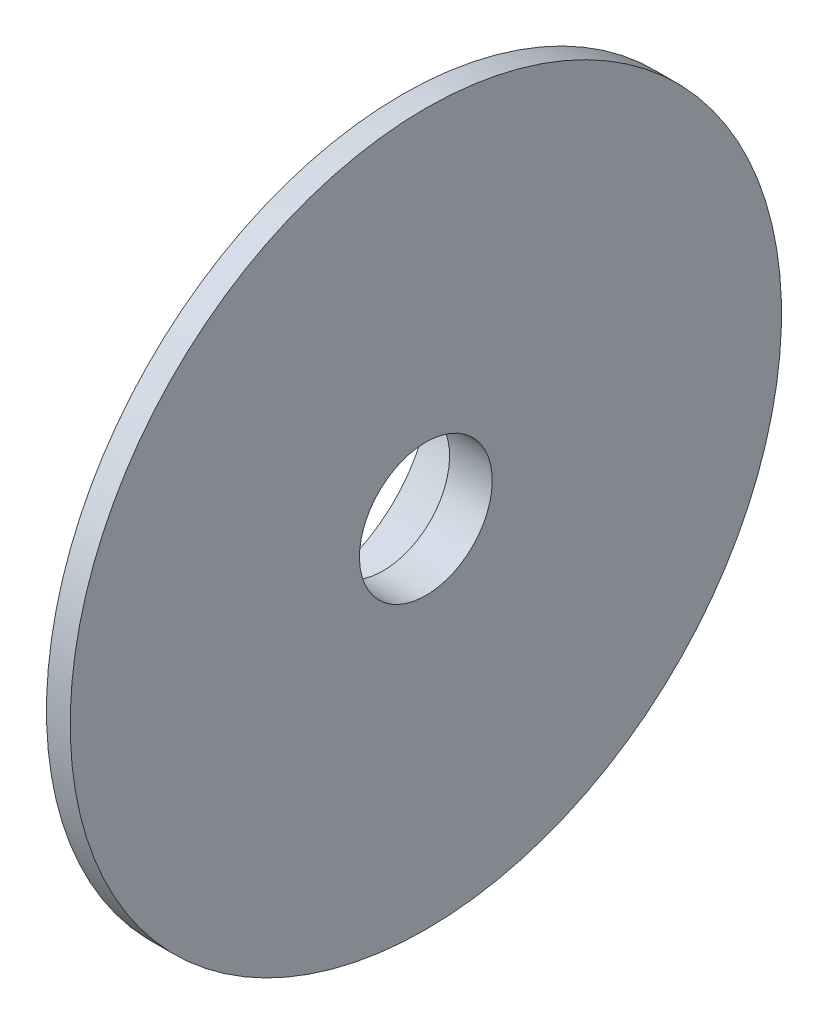
ISO-10303-21;
HEADER;
FILE_DESCRIPTION(('STEP AP214'),'2;1');
FILE_NAME('part.step','',(''),(''),'','','');
FILE_SCHEMA(('AUTOMOTIVE_DESIGN { 1 0 10303 214 1 1 1 1 }'));
ENDSEC;
DATA;
#1=APPLICATION_CONTEXT('core data for automotive mechanical design processes');
#2=APPLICATION_PROTOCOL_DEFINITION('international standard','automotive_design',2000,#1);
#3=PRODUCT_CONTEXT('',#1,'mechanical');
#4=PRODUCT('Part','Part','',(#3));
#5=PRODUCT_RELATED_PRODUCT_CATEGORY('part','',(#4));
#6=PRODUCT_DEFINITION_FORMATION('','',#4);
#7=PRODUCT_DEFINITION_CONTEXT('part definition',#1,'design');
#8=PRODUCT_DEFINITION('design','',#6,#7);
#9=PRODUCT_DEFINITION_SHAPE('','',#8);
#10=(LENGTH_UNIT() NAMED_UNIT(*) SI_UNIT(.MILLI.,.METRE.));
#11=(NAMED_UNIT(*) PLANE_ANGLE_UNIT() SI_UNIT($,.RADIAN.));
#12=(NAMED_UNIT(*) SI_UNIT($,.STERADIAN.) SOLID_ANGLE_UNIT());
#13=UNCERTAINTY_MEASURE_WITH_UNIT(LENGTH_MEASURE(1.E-05),#10,'distance_accuracy_value','');
#14=(GEOMETRIC_REPRESENTATION_CONTEXT(3) GLOBAL_UNCERTAINTY_ASSIGNED_CONTEXT((#13)) GLOBAL_UNIT_ASSIGNED_CONTEXT((#10,
#11,#12)) REPRESENTATION_CONTEXT('',''));
#15=CARTESIAN_POINT('',(0.,0.,0.));
#16=DIRECTION('',(0.,0.,1.));
#17=DIRECTION('',(1.,0.,0.));
#18=AXIS2_PLACEMENT_3D('',#15,#16,#17);
#19=CARTESIAN_POINT('',(0.,0.,0.));
#20=DIRECTION('',(1.,0.,0.));
#21=DIRECTION('',(0.,1.,0.));
#22=AXIS2_PLACEMENT_3D('',#19,#20,#21);
#23=CYLINDRICAL_SURFACE('',#22,26.9999999999999);
#24=CARTESIAN_POINT('',(-5.99999999999999,0.,0.));
#25=DIRECTION('',(1.,0.,0.));
#26=DIRECTION('',(0.,1.,0.));
#27=AXIS2_PLACEMENT_3D('',#24,#25,#26);
#28=CIRCLE('',#27,26.9999999999999);
#29=CARTESIAN_POINT('',(-6.,26.9999999999999,0.));
#30=VERTEX_POINT('',#29);
#31=EDGE_CURVE('E10',#30,#30,#28,.T.);
#32=ORIENTED_EDGE('',*,*,#31,.T.);
#33=EDGE_LOOP('',(#32));
#34=FACE_BOUND('',#33,.T.);
#35=CARTESIAN_POINT('',(-2.5,0.,0.));
#36=DIRECTION('',(1.,0.,0.));
#37=DIRECTION('',(0.,1.,0.));
#38=AXIS2_PLACEMENT_3D('',#35,#36,#37);
#39=CIRCLE('',#38,26.9999999999999);
#40=CARTESIAN_POINT('',(-2.5,26.9999999999999,0.));
#41=VERTEX_POINT('',#40);
#42=EDGE_CURVE('E88',#41,#41,#39,.T.);
#43=ORIENTED_EDGE('',*,*,#42,.F.);
#44=EDGE_LOOP('',(#43));
#45=FACE_BOUND('',#44,.T.);
#46=ADVANCED_FACE('F24',(#34,#45),#23,.T.);
#47=CARTESIAN_POINT('',(-6.,26.9999999999999,0.));
#48=DIRECTION('',(-1.,0.,0.));
#49=DIRECTION('',(0.,-1.,0.));
#50=AXIS2_PLACEMENT_3D('',#47,#48,#49);
#51=PLANE('',#50);
#52=CARTESIAN_POINT('',(-5.99999999999999,0.,0.));
#53=DIRECTION('',(1.,0.,0.));
#54=DIRECTION('',(0.,1.,0.));
#55=AXIS2_PLACEMENT_3D('',#52,#53,#54);
#56=CIRCLE('',#55,24.9999999999999);
#57=CARTESIAN_POINT('',(-6.,24.9999999999999,0.));
#58=VERTEX_POINT('',#57);
#59=EDGE_CURVE('E30',#58,#58,#56,.T.);
#60=ORIENTED_EDGE('',*,*,#59,.T.);
#61=EDGE_LOOP('',(#60));
#62=FACE_BOUND('',#61,.T.);
#63=ORIENTED_EDGE('',*,*,#31,.F.);
#64=EDGE_LOOP('',(#63));
#65=FACE_BOUND('',#64,.T.);
#66=ADVANCED_FACE('F96',(#62,#65),#51,.T.);
#67=CARTESIAN_POINT('',(0.,0.,0.));
#68=DIRECTION('',(1.,0.,0.));
#69=DIRECTION('',(0.,1.,0.));
#70=AXIS2_PLACEMENT_3D('',#67,#68,#69);
#71=CYLINDRICAL_SURFACE('',#70,24.9999999999999);
#72=CARTESIAN_POINT('',(-2.5,0.,0.));
#73=DIRECTION('',(1.,0.,0.));
#74=DIRECTION('',(0.,1.,0.));
#75=AXIS2_PLACEMENT_3D('',#72,#73,#74);
#76=CIRCLE('',#75,24.9999999999999);
#77=CARTESIAN_POINT('',(-2.5,24.9999999999999,0.));
#78=VERTEX_POINT('',#77);
#79=EDGE_CURVE('E34',#78,#78,#76,.T.);
#80=ORIENTED_EDGE('',*,*,#79,.T.);
#81=EDGE_LOOP('',(#80));
#82=FACE_BOUND('',#81,.T.);
#83=ORIENTED_EDGE('',*,*,#59,.F.);
#84=EDGE_LOOP('',(#83));
#85=FACE_BOUND('',#84,.T.);
#86=ADVANCED_FACE('F100',(#82,#85),#71,.F.);
#87=CARTESIAN_POINT('',(-2.5,24.9999999999999,0.));
#88=DIRECTION('',(-1.,0.,0.));
#89=DIRECTION('',(0.,-1.,0.));
#90=AXIS2_PLACEMENT_3D('',#87,#88,#89);
#91=PLANE('',#90);
#92=CARTESIAN_POINT('',(-2.5,0.,0.));
#93=DIRECTION('',(1.,0.,0.));
#94=DIRECTION('',(0.,1.,0.));
#95=AXIS2_PLACEMENT_3D('',#92,#93,#94);
#96=CIRCLE('',#95,14.9999999999999);
#97=CARTESIAN_POINT('',(-2.5,14.9999999999999,0.));
#98=VERTEX_POINT('',#97);
#99=EDGE_CURVE('E38',#98,#98,#96,.T.);
#100=ORIENTED_EDGE('',*,*,#99,.T.);
#101=EDGE_LOOP('',(#100));
#102=FACE_BOUND('',#101,.T.);
#103=ORIENTED_EDGE('',*,*,#79,.F.);
#104=EDGE_LOOP('',(#103));
#105=FACE_BOUND('',#104,.T.);
#106=ADVANCED_FACE('F104',(#102,#105),#91,.T.);
#107=CARTESIAN_POINT('',(0.,0.,0.));
#108=DIRECTION('',(1.,0.,0.));
#109=DIRECTION('',(0.,1.,0.));
#110=AXIS2_PLACEMENT_3D('',#107,#108,#109);
#111=CYLINDRICAL_SURFACE('',#110,14.9999999999999);
#112=CARTESIAN_POINT('',(-7.5,0.,0.));
#113=DIRECTION('',(1.,0.,0.));
#114=DIRECTION('',(0.,1.,0.));
#115=AXIS2_PLACEMENT_3D('',#112,#113,#114);
#116=CIRCLE('',#115,14.9999999999999);
#117=CARTESIAN_POINT('',(-7.5,14.9999999999999,0.));
#118=VERTEX_POINT('',#117);
#119=EDGE_CURVE('E43',#118,#118,#116,.T.);
#120=ORIENTED_EDGE('',*,*,#119,.T.);
#121=EDGE_LOOP('',(#120));
#122=FACE_BOUND('',#121,.T.);
#123=ORIENTED_EDGE('',*,*,#99,.F.);
#124=EDGE_LOOP('',(#123));
#125=FACE_BOUND('',#124,.T.);
#126=ADVANCED_FACE('F111',(#122,#125),#111,.T.);
#127=CARTESIAN_POINT('',(-7.5,14.9999999999999,0.));
#128=DIRECTION('',(-1.,0.,0.));
#129=DIRECTION('',(0.,-1.,0.));
#130=AXIS2_PLACEMENT_3D('',#127,#128,#129);
#131=PLANE('',#130);
#132=CARTESIAN_POINT('',(-7.5,0.,0.));
#133=DIRECTION('',(1.,0.,0.));
#134=DIRECTION('',(0.,1.,0.));
#135=AXIS2_PLACEMENT_3D('',#132,#133,#134);
#136=CIRCLE('',#135,14.3499999999999);
#137=CARTESIAN_POINT('',(-7.5,14.3499999999999,0.));
#138=VERTEX_POINT('',#137);
#139=EDGE_CURVE('E46',#138,#138,#136,.T.);
#140=ORIENTED_EDGE('',*,*,#139,.T.);
#141=EDGE_LOOP('',(#140));
#142=FACE_BOUND('',#141,.T.);
#143=ORIENTED_EDGE('',*,*,#119,.F.);
#144=EDGE_LOOP('',(#143));
#145=FACE_BOUND('',#144,.T.);
#146=ADVANCED_FACE('F115',(#142,#145),#131,.T.);
#147=CARTESIAN_POINT('',(0.,0.,0.));
#148=DIRECTION('',(1.,0.,0.));
#149=DIRECTION('',(0.,1.,0.));
#150=AXIS2_PLACEMENT_3D('',#147,#148,#149);
#151=CYLINDRICAL_SURFACE('',#150,14.3499999999999);
#152=CARTESIAN_POINT('',(-8.49999999999999,0.,0.));
#153=DIRECTION('',(1.,0.,0.));
#154=DIRECTION('',(0.,1.,0.));
#155=AXIS2_PLACEMENT_3D('',#152,#153,#154);
#156=CIRCLE('',#155,14.3499999999999);
#157=CARTESIAN_POINT('',(-8.5,14.3499999999999,0.));
#158=VERTEX_POINT('',#157);
#159=EDGE_CURVE('E49',#158,#158,#156,.T.);
#160=ORIENTED_EDGE('',*,*,#159,.T.);
#161=EDGE_LOOP('',(#160));
#162=FACE_BOUND('',#161,.T.);
#163=ORIENTED_EDGE('',*,*,#139,.F.);
#164=EDGE_LOOP('',(#163));
#165=FACE_BOUND('',#164,.T.);
#166=ADVANCED_FACE('F119',(#162,#165),#151,.T.);
#167=CARTESIAN_POINT('',(-8.5,14.3499999999999,0.));
#168=DIRECTION('',(1.,0.,0.));
#169=DIRECTION('',(0.,1.,0.));
#170=AXIS2_PLACEMENT_3D('',#167,#168,#169);
#171=PLANE('',#170);
#172=CARTESIAN_POINT('',(-8.49999999999999,0.,0.));
#173=DIRECTION('',(1.,0.,0.));
#174=DIRECTION('',(0.,1.,0.));
#175=AXIS2_PLACEMENT_3D('',#172,#173,#174);
#176=CIRCLE('',#175,14.9999999999999);
#177=CARTESIAN_POINT('',(-8.5,14.9999999999999,0.));
#178=VERTEX_POINT('',#177);
#179=EDGE_CURVE('E52',#178,#178,#176,.T.);
#180=ORIENTED_EDGE('',*,*,#179,.T.);
#181=EDGE_LOOP('',(#180));
#182=FACE_BOUND('',#181,.T.);
#183=ORIENTED_EDGE('',*,*,#159,.F.);
#184=EDGE_LOOP('',(#183));
#185=FACE_BOUND('',#184,.T.);
#186=ADVANCED_FACE('F123',(#182,#185),#171,.T.);
#187=CARTESIAN_POINT('',(0.,0.,0.));
#188=DIRECTION('',(1.,0.,0.));
#189=DIRECTION('',(0.,1.,0.));
#190=AXIS2_PLACEMENT_3D('',#187,#188,#189);
#191=CYLINDRICAL_SURFACE('',#190,14.9999999999999);
#192=CARTESIAN_POINT('',(-12.5,0.,0.));
#193=DIRECTION('',(1.,0.,0.));
#194=DIRECTION('',(0.,1.,0.));
#195=AXIS2_PLACEMENT_3D('',#192,#193,#194);
#196=CIRCLE('',#195,14.9999999999999);
#197=CARTESIAN_POINT('',(-12.5,14.9999999999999,0.));
#198=VERTEX_POINT('',#197);
#199=EDGE_CURVE('E55',#198,#198,#196,.T.);
#200=ORIENTED_EDGE('',*,*,#199,.T.);
#201=EDGE_LOOP('',(#200));
#202=FACE_BOUND('',#201,.T.);
#203=ORIENTED_EDGE('',*,*,#179,.F.);
#204=EDGE_LOOP('',(#203));
#205=FACE_BOUND('',#204,.T.);
#206=ADVANCED_FACE('F127',(#202,#205),#191,.T.);
#207=CARTESIAN_POINT('',(-12.5,14.9999999999999,0.));
#208=DIRECTION('',(-1.,0.,0.));
#209=DIRECTION('',(0.,-1.,0.));
#210=AXIS2_PLACEMENT_3D('',#207,#208,#209);
#211=PLANE('',#210);
#212=CARTESIAN_POINT('',(-12.5,0.,0.));
#213=DIRECTION('',(1.,0.,0.));
#214=DIRECTION('',(0.,1.,0.));
#215=AXIS2_PLACEMENT_3D('',#212,#213,#214);
#216=CIRCLE('',#215,12.9999999999999);
#217=CARTESIAN_POINT('',(-12.5,12.9999999999999,0.));
#218=VERTEX_POINT('',#217);
#219=EDGE_CURVE('E58',#218,#218,#216,.T.);
#220=ORIENTED_EDGE('',*,*,#219,.T.);
#221=EDGE_LOOP('',(#220));
#222=FACE_BOUND('',#221,.T.);
#223=ORIENTED_EDGE('',*,*,#199,.F.);
#224=EDGE_LOOP('',(#223));
#225=FACE_BOUND('',#224,.T.);
#226=ADVANCED_FACE('F131',(#222,#225),#211,.T.);
#227=CARTESIAN_POINT('',(0.,0.,0.));
#228=DIRECTION('',(1.,0.,0.));
#229=DIRECTION('',(0.,1.,0.));
#230=AXIS2_PLACEMENT_3D('',#227,#228,#229);
#231=CYLINDRICAL_SURFACE('',#230,12.9999999999999);
#232=CARTESIAN_POINT('',(-5.,0.,0.));
#233=DIRECTION('',(1.,0.,0.));
#234=DIRECTION('',(0.,1.,0.));
#235=AXIS2_PLACEMENT_3D('',#232,#233,#234);
#236=CIRCLE('',#235,12.9999999999999);
#237=CARTESIAN_POINT('',(-5.,12.9999999999999,0.));
#238=VERTEX_POINT('',#237);
#239=EDGE_CURVE('E61',#238,#238,#236,.T.);
#240=ORIENTED_EDGE('',*,*,#239,.T.);
#241=EDGE_LOOP('',(#240));
#242=FACE_BOUND('',#241,.T.);
#243=ORIENTED_EDGE('',*,*,#219,.F.);
#244=EDGE_LOOP('',(#243));
#245=FACE_BOUND('',#244,.T.);
#246=ADVANCED_FACE('F135',(#242,#245),#231,.F.);
#247=CARTESIAN_POINT('',(-5.,12.9999999999999,0.));
#248=DIRECTION('',(-1.,0.,0.));
#249=DIRECTION('',(0.,-1.,0.));
#250=AXIS2_PLACEMENT_3D('',#247,#248,#249);
#251=PLANE('',#250);
#252=CARTESIAN_POINT('',(-5.,0.,0.));
#253=DIRECTION('',(1.,0.,0.));
#254=DIRECTION('',(0.,1.,0.));
#255=AXIS2_PLACEMENT_3D('',#252,#253,#254);
#256=CIRCLE('',#255,11.4999999999999);
#257=CARTESIAN_POINT('',(-5.,11.4999999999999,0.));
#258=VERTEX_POINT('',#257);
#259=EDGE_CURVE('E64',#258,#258,#256,.T.);
#260=ORIENTED_EDGE('',*,*,#259,.T.);
#261=EDGE_LOOP('',(#260));
#262=FACE_BOUND('',#261,.T.);
#263=ORIENTED_EDGE('',*,*,#239,.F.);
#264=EDGE_LOOP('',(#263));
#265=FACE_BOUND('',#264,.T.);
#266=ADVANCED_FACE('F139',(#262,#265),#251,.T.);
#267=CARTESIAN_POINT('',(0.,0.,0.));
#268=DIRECTION('',(1.,0.,0.));
#269=DIRECTION('',(0.,1.,0.));
#270=AXIS2_PLACEMENT_3D('',#267,#268,#269);
#271=CYLINDRICAL_SURFACE('',#270,11.4999999999999);
#272=CARTESIAN_POINT('',(-2.,0.,0.));
#273=DIRECTION('',(1.,0.,0.));
#274=DIRECTION('',(0.,1.,0.));
#275=AXIS2_PLACEMENT_3D('',#272,#273,#274);
#276=CIRCLE('',#275,11.4999999999999);
#277=CARTESIAN_POINT('',(-2.,11.4999999999999,0.));
#278=VERTEX_POINT('',#277);
#279=EDGE_CURVE('E67',#278,#278,#276,.T.);
#280=ORIENTED_EDGE('',*,*,#279,.T.);
#281=EDGE_LOOP('',(#280));
#282=FACE_BOUND('',#281,.T.);
#283=ORIENTED_EDGE('',*,*,#259,.F.);
#284=EDGE_LOOP('',(#283));
#285=FACE_BOUND('',#284,.T.);
#286=ADVANCED_FACE('F143',(#282,#285),#271,.F.);
#287=CARTESIAN_POINT('',(-2.,11.4999999999999,0.));
#288=DIRECTION('',(-1.,0.,0.));
#289=DIRECTION('',(0.,-1.,0.));
#290=AXIS2_PLACEMENT_3D('',#287,#288,#289);
#291=PLANE('',#290);
#292=CARTESIAN_POINT('',(-2.,0.,0.));
#293=DIRECTION('',(1.,0.,0.));
#294=DIRECTION('',(0.,1.,0.));
#295=AXIS2_PLACEMENT_3D('',#292,#293,#294);
#296=CIRCLE('',#295,8.99999999999994);
#297=CARTESIAN_POINT('',(-2.,8.99999999999994,0.));
#298=VERTEX_POINT('',#297);
#299=EDGE_CURVE('E70',#298,#298,#296,.T.);
#300=ORIENTED_EDGE('',*,*,#299,.T.);
#301=EDGE_LOOP('',(#300));
#302=FACE_BOUND('',#301,.T.);
#303=ORIENTED_EDGE('',*,*,#279,.F.);
#304=EDGE_LOOP('',(#303));
#305=FACE_BOUND('',#304,.T.);
#306=ADVANCED_FACE('F147',(#302,#305),#291,.T.);
#307=CARTESIAN_POINT('',(0.,0.,0.));
#308=DIRECTION('',(1.,0.,0.));
#309=DIRECTION('',(0.,1.,0.));
#310=AXIS2_PLACEMENT_3D('',#307,#308,#309);
#311=CYLINDRICAL_SURFACE('',#310,8.99999999999994);
#312=CARTESIAN_POINT('',(-4.5,0.,0.));
#313=DIRECTION('',(1.,0.,0.));
#314=DIRECTION('',(0.,1.,0.));
#315=AXIS2_PLACEMENT_3D('',#312,#313,#314);
#316=CIRCLE('',#315,8.99999999999994);
#317=CARTESIAN_POINT('',(-4.5,8.99999999999994,0.));
#318=VERTEX_POINT('',#317);
#319=EDGE_CURVE('E73',#318,#318,#316,.T.);
#320=ORIENTED_EDGE('',*,*,#319,.T.);
#321=EDGE_LOOP('',(#320));
#322=FACE_BOUND('',#321,.T.);
#323=ORIENTED_EDGE('',*,*,#299,.F.);
#324=EDGE_LOOP('',(#323));
#325=FACE_BOUND('',#324,.T.);
#326=ADVANCED_FACE('F151',(#322,#325),#311,.T.);
#327=CARTESIAN_POINT('',(-4.5,8.99999999999994,0.));
#328=DIRECTION('',(-1.,0.,0.));
#329=DIRECTION('',(0.,-1.,0.));
#330=AXIS2_PLACEMENT_3D('',#327,#328,#329);
#331=PLANE('',#330);
#332=CARTESIAN_POINT('',(-4.5,0.,0.));
#333=DIRECTION('',(1.,0.,0.));
#334=DIRECTION('',(0.,1.,0.));
#335=AXIS2_PLACEMENT_3D('',#332,#333,#334);
#336=CIRCLE('',#335,6.99999999999995);
#337=CARTESIAN_POINT('',(-4.5,6.99999999999995,0.));
#338=VERTEX_POINT('',#337);
#339=EDGE_CURVE('E76',#338,#338,#336,.T.);
#340=ORIENTED_EDGE('',*,*,#339,.T.);
#341=EDGE_LOOP('',(#340));
#342=FACE_BOUND('',#341,.T.);
#343=ORIENTED_EDGE('',*,*,#319,.F.);
#344=EDGE_LOOP('',(#343));
#345=FACE_BOUND('',#344,.T.);
#346=ADVANCED_FACE('F155',(#342,#345),#331,.T.);
#347=CARTESIAN_POINT('',(0.,0.,0.));
#348=DIRECTION('',(1.,0.,0.));
#349=DIRECTION('',(0.,1.,0.));
#350=AXIS2_PLACEMENT_3D('',#347,#348,#349);
#351=CYLINDRICAL_SURFACE('',#350,6.99999999999995);
#352=CARTESIAN_POINT('',(0.,0.,0.));
#353=DIRECTION('',(1.,0.,0.));
#354=DIRECTION('',(0.,1.,0.));
#355=AXIS2_PLACEMENT_3D('',#352,#353,#354);
#356=CIRCLE('',#355,6.99999999999995);
#357=CARTESIAN_POINT('',(0.,6.99999999999995,0.));
#358=VERTEX_POINT('',#357);
#359=EDGE_CURVE('E79',#358,#358,#356,.T.);
#360=ORIENTED_EDGE('',*,*,#359,.T.);
#361=EDGE_LOOP('',(#360));
#362=FACE_BOUND('',#361,.T.);
#363=ORIENTED_EDGE('',*,*,#339,.F.);
#364=EDGE_LOOP('',(#363));
#365=FACE_BOUND('',#364,.T.);
#366=ADVANCED_FACE('F159',(#362,#365),#351,.F.);
#367=CARTESIAN_POINT('',(0.,37.5,0.));
#368=DIRECTION('',(1.,0.,0.));
#369=DIRECTION('',(0.,1.,0.));
#370=AXIS2_PLACEMENT_3D('',#367,#368,#369);
#371=PLANE('',#370);
#372=CARTESIAN_POINT('',(0.,0.,0.));
#373=DIRECTION('',(1.,0.,0.));
#374=DIRECTION('',(0.,1.,0.));
#375=AXIS2_PLACEMENT_3D('',#372,#373,#374);
#376=CIRCLE('',#375,37.5);
#377=CARTESIAN_POINT('',(0.,37.5,0.));
#378=VERTEX_POINT('',#377);
#379=EDGE_CURVE('E82',#378,#378,#376,.T.);
#380=ORIENTED_EDGE('',*,*,#379,.T.);
#381=EDGE_LOOP('',(#380));
#382=FACE_BOUND('',#381,.T.);
#383=ORIENTED_EDGE('',*,*,#359,.F.);
#384=EDGE_LOOP('',(#383));
#385=FACE_BOUND('',#384,.T.);
#386=ADVANCED_FACE('F163',(#382,#385),#371,.T.);
#387=CARTESIAN_POINT('',(0.,0.,0.));
#388=DIRECTION('',(1.,0.,0.));
#389=DIRECTION('',(0.,1.,0.));
#390=AXIS2_PLACEMENT_3D('',#387,#388,#389);
#391=CYLINDRICAL_SURFACE('',#390,37.5);
#392=CARTESIAN_POINT('',(-2.5,0.,0.));
#393=DIRECTION('',(1.,0.,0.));
#394=DIRECTION('',(0.,1.,0.));
#395=AXIS2_PLACEMENT_3D('',#392,#393,#394);
#396=CIRCLE('',#395,37.5);
#397=CARTESIAN_POINT('',(-2.5,37.5,0.));
#398=VERTEX_POINT('',#397);
#399=EDGE_CURVE('E85',#398,#398,#396,.T.);
#400=ORIENTED_EDGE('',*,*,#399,.T.);
#401=EDGE_LOOP('',(#400));
#402=FACE_BOUND('',#401,.T.);
#403=ORIENTED_EDGE('',*,*,#379,.F.);
#404=EDGE_LOOP('',(#403));
#405=FACE_BOUND('',#404,.T.);
#406=ADVANCED_FACE('F167',(#402,#405),#391,.T.);
#407=CARTESIAN_POINT('',(-2.5,37.5,0.));
#408=DIRECTION('',(-1.,0.,0.));
#409=DIRECTION('',(0.,-1.,0.));
#410=AXIS2_PLACEMENT_3D('',#407,#408,#409);
#411=PLANE('',#410);
#412=ORIENTED_EDGE('',*,*,#42,.T.);
#413=EDGE_LOOP('',(#412));
#414=FACE_BOUND('',#413,.T.);
#415=ORIENTED_EDGE('',*,*,#399,.F.);
#416=EDGE_LOOP('',(#415));
#417=FACE_BOUND('',#416,.T.);
#418=ADVANCED_FACE('F92',(#414,#417),#411,.T.);
#419=CLOSED_SHELL('',(#46,#66,#86,#106,#126,#146,#166,#186,#206,#226,#246,#266,#286,#306,#326,
#346,#366,#386,#406,#418));
#420=MANIFOLD_SOLID_BREP('B2',#419);
#421=ADVANCED_BREP_SHAPE_REPRESENTATION('',(#18,#420),#14);
#422=SHAPE_DEFINITION_REPRESENTATION(#9,#421);
ENDSEC;
END-ISO-10303-21;
